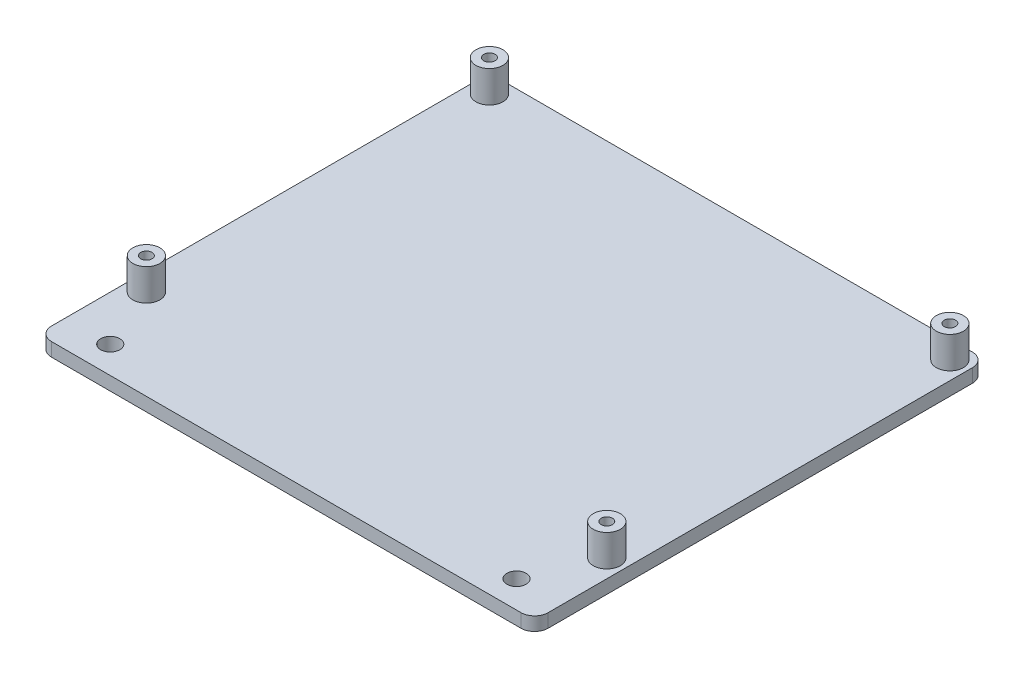
ISO-10303-21;
HEADER;
FILE_DESCRIPTION(('STEP AP214'),'2;1');
FILE_NAME('part.step','',(''),(''),'','','');
FILE_SCHEMA(('AUTOMOTIVE_DESIGN { 1 0 10303 214 1 1 1 1 }'));
ENDSEC;
DATA;
#1=APPLICATION_CONTEXT('core data for automotive mechanical design processes');
#2=APPLICATION_PROTOCOL_DEFINITION('international standard','automotive_design',2000,#1);
#3=PRODUCT_CONTEXT('',#1,'mechanical');
#4=PRODUCT('Part','Part','',(#3));
#5=PRODUCT_RELATED_PRODUCT_CATEGORY('part','',(#4));
#6=PRODUCT_DEFINITION_FORMATION('','',#4);
#7=PRODUCT_DEFINITION_CONTEXT('part definition',#1,'design');
#8=PRODUCT_DEFINITION('design','',#6,#7);
#9=PRODUCT_DEFINITION_SHAPE('','',#8);
#10=(LENGTH_UNIT() NAMED_UNIT(*) SI_UNIT(.MILLI.,.METRE.));
#11=(NAMED_UNIT(*) PLANE_ANGLE_UNIT() SI_UNIT($,.RADIAN.));
#12=(NAMED_UNIT(*) SI_UNIT($,.STERADIAN.) SOLID_ANGLE_UNIT());
#13=UNCERTAINTY_MEASURE_WITH_UNIT(LENGTH_MEASURE(1.E-05),#10,'distance_accuracy_value','');
#14=(GEOMETRIC_REPRESENTATION_CONTEXT(3) GLOBAL_UNCERTAINTY_ASSIGNED_CONTEXT((#13)) GLOBAL_UNIT_ASSIGNED_CONTEXT((#10,
#11,#12)) REPRESENTATION_CONTEXT('',''));
#15=CARTESIAN_POINT('',(0.,0.,0.));
#16=DIRECTION('',(0.,0.,1.));
#17=DIRECTION('',(1.,0.,0.));
#18=AXIS2_PLACEMENT_3D('',#15,#16,#17);
#19=CARTESIAN_POINT('',(0.,3.,0.));
#20=DIRECTION('',(0.,-1.,0.));
#21=DIRECTION('',(0.,0.,-1.));
#22=AXIS2_PLACEMENT_3D('',#19,#20,#21);
#23=PLANE('',#22);
#24=CARTESIAN_POINT('',(10.,3.,-6.));
#25=DIRECTION('',(0.,-1.,0.));
#26=DIRECTION('',(0.,0.,-1.));
#27=AXIS2_PLACEMENT_3D('',#24,#25,#26);
#28=CIRCLE('',#27,2.125);
#29=CARTESIAN_POINT('',(10.,3.,-8.125));
#30=VERTEX_POINT('',#29);
#31=EDGE_CURVE('E319',#30,#30,#28,.T.);
#32=ORIENTED_EDGE('',*,*,#31,.T.);
#33=EDGE_LOOP('',(#32));
#34=FACE_BOUND('',#33,.T.);
#35=CARTESIAN_POINT('',(100.,3.,-6.));
#36=DIRECTION('',(0.,-1.,0.));
#37=DIRECTION('',(0.,0.,-1.));
#38=AXIS2_PLACEMENT_3D('',#35,#36,#37);
#39=CIRCLE('',#38,2.125);
#40=CARTESIAN_POINT('',(100.,3.,-8.125));
#41=VERTEX_POINT('',#40);
#42=EDGE_CURVE('E322',#41,#41,#39,.T.);
#43=ORIENTED_EDGE('',*,*,#42,.T.);
#44=EDGE_LOOP('',(#43));
#45=FACE_BOUND('',#44,.T.);
#46=CARTESIAN_POINT('',(106.,3.,-20.));
#47=DIRECTION('',(0.,-1.,0.));
#48=DIRECTION('',(0.,0.,-1.));
#49=AXIS2_PLACEMENT_3D('',#46,#47,#48);
#50=CIRCLE('',#49,3.00000000000001);
#51=CARTESIAN_POINT('',(106.,3.,-23.));
#52=VERTEX_POINT('',#51);
#53=EDGE_CURVE('E42',#52,#52,#50,.F.);
#54=ORIENTED_EDGE('',*,*,#53,.F.);
#55=EDGE_LOOP('',(#54));
#56=FACE_BOUND('',#55,.T.);
#57=CARTESIAN_POINT('',(4.,3.,-96.));
#58=DIRECTION('',(0.,-1.,0.));
#59=DIRECTION('',(0.,0.,-1.));
#60=AXIS2_PLACEMENT_3D('',#57,#58,#59);
#61=CIRCLE('',#60,3.);
#62=CARTESIAN_POINT('',(4.,3.,-99.));
#63=VERTEX_POINT('',#62);
#64=EDGE_CURVE('E169',#63,#63,#61,.F.);
#65=ORIENTED_EDGE('',*,*,#64,.F.);
#66=EDGE_LOOP('',(#65));
#67=FACE_BOUND('',#66,.T.);
#68=DIRECTION('',(0.,0.,1.));
#69=VECTOR('',#68,1.);
#70=CARTESIAN_POINT('',(0.,3.,0.));
#71=LINE('',#70,#69);
#72=CARTESIAN_POINT('',(0.,3.,-97.));
#73=VERTEX_POINT('',#72);
#74=CARTESIAN_POINT('',(0.,3.,-3.));
#75=VERTEX_POINT('',#74);
#76=EDGE_CURVE('E144',#73,#75,#71,.T.);
#77=ORIENTED_EDGE('',*,*,#76,.T.);
#78=CARTESIAN_POINT('',(3.,3.,-3.));
#79=DIRECTION('',(0.,-1.,0.));
#80=DIRECTION('',(0.,0.,-1.));
#81=AXIS2_PLACEMENT_3D('',#78,#79,#80);
#82=CIRCLE('',#81,3.);
#83=CARTESIAN_POINT('',(3.,3.,0.));
#84=VERTEX_POINT('',#83);
#85=EDGE_CURVE('E158',#75,#84,#82,.F.);
#86=ORIENTED_EDGE('',*,*,#85,.T.);
#87=DIRECTION('',(1.,0.,0.));
#88=VECTOR('',#87,1.);
#89=CARTESIAN_POINT('',(0.,3.,0.));
#90=LINE('',#89,#88);
#91=CARTESIAN_POINT('',(107.,3.,0.));
#92=VERTEX_POINT('',#91);
#93=EDGE_CURVE('E121',#84,#92,#90,.T.);
#94=ORIENTED_EDGE('',*,*,#93,.T.);
#95=CARTESIAN_POINT('',(107.,3.,-3.));
#96=DIRECTION('',(0.,-1.,0.));
#97=DIRECTION('',(0.,0.,-1.));
#98=AXIS2_PLACEMENT_3D('',#95,#96,#97);
#99=CIRCLE('',#98,3.);
#100=CARTESIAN_POINT('',(110.,3.,-3.));
#101=VERTEX_POINT('',#100);
#102=EDGE_CURVE('E156',#92,#101,#99,.F.);
#103=ORIENTED_EDGE('',*,*,#102,.T.);
#104=DIRECTION('',(0.,0.,-1.));
#105=VECTOR('',#104,1.);
#106=CARTESIAN_POINT('',(110.,3.,0.));
#107=LINE('',#106,#105);
#108=CARTESIAN_POINT('',(110.,3.,-97.));
#109=VERTEX_POINT('',#108);
#110=EDGE_CURVE('E278',#101,#109,#107,.T.);
#111=ORIENTED_EDGE('',*,*,#110,.T.);
#112=CARTESIAN_POINT('',(107.,3.,-97.));
#113=DIRECTION('',(0.,-1.,0.));
#114=DIRECTION('',(0.,0.,-1.));
#115=AXIS2_PLACEMENT_3D('',#112,#113,#114);
#116=CIRCLE('',#115,3.);
#117=CARTESIAN_POINT('',(107.,3.,-100.));
#118=VERTEX_POINT('',#117);
#119=EDGE_CURVE('E56',#109,#118,#116,.F.);
#120=ORIENTED_EDGE('',*,*,#119,.T.);
#121=DIRECTION('',(-1.,0.,0.));
#122=VECTOR('',#121,1.);
#123=CARTESIAN_POINT('',(0.,3.,-100.));
#124=LINE('',#123,#122);
#125=CARTESIAN_POINT('',(3.,3.,-100.));
#126=VERTEX_POINT('',#125);
#127=EDGE_CURVE('E138',#118,#126,#124,.T.);
#128=ORIENTED_EDGE('',*,*,#127,.T.);
#129=CARTESIAN_POINT('',(3.,3.,-97.));
#130=DIRECTION('',(0.,-1.,0.));
#131=DIRECTION('',(0.,0.,-1.));
#132=AXIS2_PLACEMENT_3D('',#129,#130,#131);
#133=CIRCLE('',#132,3.);
#134=EDGE_CURVE('E154',#126,#73,#133,.F.);
#135=ORIENTED_EDGE('',*,*,#134,.T.);
#136=EDGE_LOOP('',(#77,#86,#94,#103,#111,#120,#128,#135));
#137=FACE_BOUND('',#136,.T.);
#138=CARTESIAN_POINT('',(106.,3.,-96.));
#139=DIRECTION('',(0.,-1.,0.));
#140=DIRECTION('',(0.,0.,-1.));
#141=AXIS2_PLACEMENT_3D('',#138,#139,#140);
#142=CIRCLE('',#141,3.00000000000001);
#143=CARTESIAN_POINT('',(106.,3.,-99.));
#144=VERTEX_POINT('',#143);
#145=EDGE_CURVE('E172',#144,#144,#142,.F.);
#146=ORIENTED_EDGE('',*,*,#145,.F.);
#147=EDGE_LOOP('',(#146));
#148=FACE_BOUND('',#147,.T.);
#149=CARTESIAN_POINT('',(4.,3.,-20.));
#150=DIRECTION('',(0.,-1.,0.));
#151=DIRECTION('',(0.,0.,-1.));
#152=AXIS2_PLACEMENT_3D('',#149,#150,#151);
#153=CIRCLE('',#152,3.);
#154=CARTESIAN_POINT('',(4.,3.,-23.));
#155=VERTEX_POINT('',#154);
#156=EDGE_CURVE('E11',#155,#155,#153,.F.);
#157=ORIENTED_EDGE('',*,*,#156,.F.);
#158=EDGE_LOOP('',(#157));
#159=FACE_BOUND('',#158,.T.);
#160=ADVANCED_FACE('F34',(#34,#45,#56,#67,#137,#148,#159),#23,.F.);
#161=CARTESIAN_POINT('',(0.,0.,0.));
#162=DIRECTION('',(0.,-1.,0.));
#163=DIRECTION('',(0.,0.,-1.));
#164=AXIS2_PLACEMENT_3D('',#161,#162,#163);
#165=PLANE('',#164);
#166=CARTESIAN_POINT('',(10.,0.,-6.));
#167=DIRECTION('',(0.,-1.,0.));
#168=DIRECTION('',(0.,0.,-1.));
#169=AXIS2_PLACEMENT_3D('',#166,#167,#168);
#170=CIRCLE('',#169,2.125);
#171=CARTESIAN_POINT('',(10.,0.,-8.125));
#172=VERTEX_POINT('',#171);
#173=EDGE_CURVE('E325',#172,#172,#170,.T.);
#174=ORIENTED_EDGE('',*,*,#173,.F.);
#175=EDGE_LOOP('',(#174));
#176=FACE_BOUND('',#175,.T.);
#177=CARTESIAN_POINT('',(100.,0.,-6.));
#178=DIRECTION('',(0.,-1.,0.));
#179=DIRECTION('',(0.,0.,-1.));
#180=AXIS2_PLACEMENT_3D('',#177,#178,#179);
#181=CIRCLE('',#180,2.125);
#182=CARTESIAN_POINT('',(100.,0.,-8.125));
#183=VERTEX_POINT('',#182);
#184=EDGE_CURVE('E326',#183,#183,#181,.T.);
#185=ORIENTED_EDGE('',*,*,#184,.F.);
#186=EDGE_LOOP('',(#185));
#187=FACE_BOUND('',#186,.T.);
#188=CARTESIAN_POINT('',(106.,0.,-20.));
#189=DIRECTION('',(0.,1.,0.));
#190=DIRECTION('',(0.,0.,1.));
#191=AXIS2_PLACEMENT_3D('',#188,#189,#190);
#192=CIRCLE('',#191,1.25);
#193=CARTESIAN_POINT('',(106.,0.,-18.75));
#194=VERTEX_POINT('',#193);
#195=EDGE_CURVE('E289',#194,#194,#192,.T.);
#196=ORIENTED_EDGE('',*,*,#195,.T.);
#197=EDGE_LOOP('',(#196));
#198=FACE_BOUND('',#197,.T.);
#199=CARTESIAN_POINT('',(4.,0.,-96.));
#200=DIRECTION('',(0.,1.,0.));
#201=DIRECTION('',(0.,0.,1.));
#202=AXIS2_PLACEMENT_3D('',#199,#200,#201);
#203=CIRCLE('',#202,1.25);
#204=CARTESIAN_POINT('',(4.,0.,-94.75));
#205=VERTEX_POINT('',#204);
#206=EDGE_CURVE('E129',#205,#205,#203,.T.);
#207=ORIENTED_EDGE('',*,*,#206,.T.);
#208=EDGE_LOOP('',(#207));
#209=FACE_BOUND('',#208,.T.);
#210=DIRECTION('',(1.,0.,0.));
#211=VECTOR('',#210,1.);
#212=CARTESIAN_POINT('',(0.,0.,0.));
#213=LINE('',#212,#211);
#214=CARTESIAN_POINT('',(3.,0.,0.));
#215=VERTEX_POINT('',#214);
#216=CARTESIAN_POINT('',(107.,0.,0.));
#217=VERTEX_POINT('',#216);
#218=EDGE_CURVE('E118',#215,#217,#213,.T.);
#219=ORIENTED_EDGE('',*,*,#218,.F.);
#220=CARTESIAN_POINT('',(3.,0.,-3.));
#221=DIRECTION('',(0.,-1.,0.));
#222=DIRECTION('',(0.,0.,-1.));
#223=AXIS2_PLACEMENT_3D('',#220,#221,#222);
#224=CIRCLE('',#223,3.);
#225=CARTESIAN_POINT('',(0.,0.,-3.00000000000003));
#226=VERTEX_POINT('',#225);
#227=EDGE_CURVE('E101',#215,#226,#224,.T.);
#228=ORIENTED_EDGE('',*,*,#227,.T.);
#229=DIRECTION('',(0.,0.,1.));
#230=VECTOR('',#229,1.);
#231=CARTESIAN_POINT('',(0.,0.,-100.));
#232=LINE('',#231,#230);
#233=CARTESIAN_POINT('',(0.,0.,-97.));
#234=VERTEX_POINT('',#233);
#235=EDGE_CURVE('E142',#234,#226,#232,.T.);
#236=ORIENTED_EDGE('',*,*,#235,.F.);
#237=CARTESIAN_POINT('',(3.,0.,-97.));
#238=DIRECTION('',(0.,-1.,0.));
#239=DIRECTION('',(0.,0.,-1.));
#240=AXIS2_PLACEMENT_3D('',#237,#238,#239);
#241=CIRCLE('',#240,3.);
#242=CARTESIAN_POINT('',(3.,0.,-100.));
#243=VERTEX_POINT('',#242);
#244=EDGE_CURVE('E147',#234,#243,#241,.T.);
#245=ORIENTED_EDGE('',*,*,#244,.T.);
#246=DIRECTION('',(-1.,0.,0.));
#247=VECTOR('',#246,1.);
#248=CARTESIAN_POINT('',(0.,0.,-100.));
#249=LINE('',#248,#247);
#250=CARTESIAN_POINT('',(107.,0.,-100.));
#251=VERTEX_POINT('',#250);
#252=EDGE_CURVE('E132',#251,#243,#249,.T.);
#253=ORIENTED_EDGE('',*,*,#252,.F.);
#254=CARTESIAN_POINT('',(107.,0.,-97.));
#255=DIRECTION('',(0.,-1.,0.));
#256=DIRECTION('',(0.,0.,-1.));
#257=AXIS2_PLACEMENT_3D('',#254,#255,#256);
#258=CIRCLE('',#257,3.);
#259=CARTESIAN_POINT('',(110.,0.,-97.));
#260=VERTEX_POINT('',#259);
#261=EDGE_CURVE('E122',#251,#260,#258,.T.);
#262=ORIENTED_EDGE('',*,*,#261,.T.);
#263=DIRECTION('',(0.,0.,-1.));
#264=VECTOR('',#263,1.);
#265=CARTESIAN_POINT('',(110.,0.,-100.));
#266=LINE('',#265,#264);
#267=CARTESIAN_POINT('',(110.,0.,-3.00000000000003));
#268=VERTEX_POINT('',#267);
#269=EDGE_CURVE('E128',#268,#260,#266,.T.);
#270=ORIENTED_EDGE('',*,*,#269,.F.);
#271=CARTESIAN_POINT('',(107.,0.,-3.));
#272=DIRECTION('',(0.,-1.,0.));
#273=DIRECTION('',(0.,0.,-1.));
#274=AXIS2_PLACEMENT_3D('',#271,#272,#273);
#275=CIRCLE('',#274,3.);
#276=EDGE_CURVE('E112',#268,#217,#275,.T.);
#277=ORIENTED_EDGE('',*,*,#276,.T.);
#278=EDGE_LOOP('',(#219,#228,#236,#245,#253,#262,#270,#277));
#279=FACE_BOUND('',#278,.T.);
#280=CARTESIAN_POINT('',(106.,0.,-96.));
#281=DIRECTION('',(0.,1.,0.));
#282=DIRECTION('',(0.,0.,1.));
#283=AXIS2_PLACEMENT_3D('',#280,#281,#282);
#284=CIRCLE('',#283,1.25);
#285=CARTESIAN_POINT('',(106.,0.,-94.75));
#286=VERTEX_POINT('',#285);
#287=EDGE_CURVE('E135',#286,#286,#284,.T.);
#288=ORIENTED_EDGE('',*,*,#287,.T.);
#289=EDGE_LOOP('',(#288));
#290=FACE_BOUND('',#289,.T.);
#291=CARTESIAN_POINT('',(4.,0.,-20.));
#292=DIRECTION('',(0.,1.,0.));
#293=DIRECTION('',(0.,0.,1.));
#294=AXIS2_PLACEMENT_3D('',#291,#292,#293);
#295=CIRCLE('',#294,1.25);
#296=CARTESIAN_POINT('',(4.,0.,-18.75));
#297=VERTEX_POINT('',#296);
#298=EDGE_CURVE('E292',#297,#297,#295,.T.);
#299=ORIENTED_EDGE('',*,*,#298,.T.);
#300=EDGE_LOOP('',(#299));
#301=FACE_BOUND('',#300,.T.);
#302=ADVANCED_FACE('F125',(#176,#187,#198,#209,#279,#290,#301),#165,.T.);
#303=CARTESIAN_POINT('',(0.,3.,0.));
#304=DIRECTION('',(0.,0.,-1.));
#305=DIRECTION('',(-1.,0.,0.));
#306=AXIS2_PLACEMENT_3D('',#303,#304,#305);
#307=PLANE('',#306);
#308=ORIENTED_EDGE('',*,*,#93,.F.);
#309=DIRECTION('',(0.,-1.,0.));
#310=VECTOR('',#309,1.);
#311=CARTESIAN_POINT('',(3.,3.,0.));
#312=LINE('',#311,#310);
#313=EDGE_CURVE('E105',#84,#215,#312,.T.);
#314=ORIENTED_EDGE('',*,*,#313,.T.);
#315=ORIENTED_EDGE('',*,*,#218,.T.);
#316=DIRECTION('',(0.,-1.,0.));
#317=VECTOR('',#316,1.);
#318=CARTESIAN_POINT('',(107.,3.,0.));
#319=LINE('',#318,#317);
#320=EDGE_CURVE('E123',#217,#92,#319,.F.);
#321=ORIENTED_EDGE('',*,*,#320,.T.);
#322=EDGE_LOOP('',(#308,#314,#315,#321));
#323=FACE_BOUND('',#322,.T.);
#324=ADVANCED_FACE('F117',(#323),#307,.F.);
#325=CARTESIAN_POINT('',(110.,3.,-100.));
#326=DIRECTION('',(-1.,0.,0.));
#327=DIRECTION('',(0.,0.,1.));
#328=AXIS2_PLACEMENT_3D('',#325,#326,#327);
#329=PLANE('',#328);
#330=ORIENTED_EDGE('',*,*,#110,.F.);
#331=DIRECTION('',(0.,-1.,0.));
#332=VECTOR('',#331,1.);
#333=CARTESIAN_POINT('',(110.,3.,-3.));
#334=LINE('',#333,#332);
#335=EDGE_CURVE('E162',#101,#268,#334,.T.);
#336=ORIENTED_EDGE('',*,*,#335,.T.);
#337=ORIENTED_EDGE('',*,*,#269,.T.);
#338=DIRECTION('',(0.,-1.,0.));
#339=VECTOR('',#338,1.);
#340=CARTESIAN_POINT('',(110.,3.,-97.));
#341=LINE('',#340,#339);
#342=EDGE_CURVE('E160',#260,#109,#341,.F.);
#343=ORIENTED_EDGE('',*,*,#342,.T.);
#344=EDGE_LOOP('',(#330,#336,#337,#343));
#345=FACE_BOUND('',#344,.T.);
#346=ADVANCED_FACE('F257',(#345),#329,.F.);
#347=CARTESIAN_POINT('',(0.,3.,-100.));
#348=DIRECTION('',(0.,0.,1.));
#349=DIRECTION('',(1.,0.,0.));
#350=AXIS2_PLACEMENT_3D('',#347,#348,#349);
#351=PLANE('',#350);
#352=ORIENTED_EDGE('',*,*,#252,.T.);
#353=DIRECTION('',(0.,-1.,0.));
#354=VECTOR('',#353,1.);
#355=CARTESIAN_POINT('',(3.,3.,-100.));
#356=LINE('',#355,#354);
#357=EDGE_CURVE('E49',#243,#126,#356,.F.);
#358=ORIENTED_EDGE('',*,*,#357,.T.);
#359=ORIENTED_EDGE('',*,*,#127,.F.);
#360=DIRECTION('',(0.,-1.,0.));
#361=VECTOR('',#360,1.);
#362=CARTESIAN_POINT('',(107.,3.,-100.));
#363=LINE('',#362,#361);
#364=EDGE_CURVE('E165',#118,#251,#363,.T.);
#365=ORIENTED_EDGE('',*,*,#364,.T.);
#366=EDGE_LOOP('',(#352,#358,#359,#365));
#367=FACE_BOUND('',#366,.T.);
#368=ADVANCED_FACE('F253',(#367),#351,.F.);
#369=CARTESIAN_POINT('',(0.,3.,-100.));
#370=DIRECTION('',(1.,0.,0.));
#371=DIRECTION('',(0.,0.,-1.));
#372=AXIS2_PLACEMENT_3D('',#369,#370,#371);
#373=PLANE('',#372);
#374=ORIENTED_EDGE('',*,*,#235,.T.);
#375=DIRECTION('',(0.,-1.,0.));
#376=VECTOR('',#375,1.);
#377=CARTESIAN_POINT('',(0.,3.,-3.));
#378=LINE('',#377,#376);
#379=EDGE_CURVE('E106',#226,#75,#378,.F.);
#380=ORIENTED_EDGE('',*,*,#379,.T.);
#381=ORIENTED_EDGE('',*,*,#76,.F.);
#382=DIRECTION('',(0.,-1.,0.));
#383=VECTOR('',#382,1.);
#384=CARTESIAN_POINT('',(0.,3.,-97.));
#385=LINE('',#384,#383);
#386=EDGE_CURVE('E111',#73,#234,#385,.T.);
#387=ORIENTED_EDGE('',*,*,#386,.T.);
#388=EDGE_LOOP('',(#374,#380,#381,#387));
#389=FACE_BOUND('',#388,.T.);
#390=ADVANCED_FACE('F245',(#389),#373,.F.);
#391=CARTESIAN_POINT('',(4.,3.,-96.));
#392=DIRECTION('',(0.,-1.,0.));
#393=DIRECTION('',(0.,0.,-1.));
#394=AXIS2_PLACEMENT_3D('',#391,#392,#393);
#395=CYLINDRICAL_SURFACE('',#394,1.25);
#396=ORIENTED_EDGE('',*,*,#206,.F.);
#397=EDGE_LOOP('',(#396));
#398=FACE_BOUND('',#397,.T.);
#399=CARTESIAN_POINT('',(4.,10.,-96.));
#400=DIRECTION('',(0.,1.,0.));
#401=DIRECTION('',(0.,0.,1.));
#402=AXIS2_PLACEMENT_3D('',#399,#400,#401);
#403=CIRCLE('',#402,1.25);
#404=CARTESIAN_POINT('',(4.,10.,-94.75));
#405=VERTEX_POINT('',#404);
#406=EDGE_CURVE('E298',#405,#405,#403,.T.);
#407=ORIENTED_EDGE('',*,*,#406,.T.);
#408=EDGE_LOOP('',(#407));
#409=FACE_BOUND('',#408,.T.);
#410=ADVANCED_FACE('F242',(#398,#409),#395,.F.);
#411=CARTESIAN_POINT('',(106.,3.,-96.));
#412=DIRECTION('',(0.,-1.,0.));
#413=DIRECTION('',(0.,0.,-1.));
#414=AXIS2_PLACEMENT_3D('',#411,#412,#413);
#415=CYLINDRICAL_SURFACE('',#414,1.25);
#416=ORIENTED_EDGE('',*,*,#287,.F.);
#417=EDGE_LOOP('',(#416));
#418=FACE_BOUND('',#417,.T.);
#419=CARTESIAN_POINT('',(106.,10.,-96.));
#420=DIRECTION('',(0.,1.,0.));
#421=DIRECTION('',(0.,0.,1.));
#422=AXIS2_PLACEMENT_3D('',#419,#420,#421);
#423=CIRCLE('',#422,1.25);
#424=CARTESIAN_POINT('',(106.,10.,-94.75));
#425=VERTEX_POINT('',#424);
#426=EDGE_CURVE('E304',#425,#425,#423,.T.);
#427=ORIENTED_EDGE('',*,*,#426,.T.);
#428=EDGE_LOOP('',(#427));
#429=FACE_BOUND('',#428,.T.);
#430=ADVANCED_FACE('F238',(#418,#429),#415,.F.);
#431=CARTESIAN_POINT('',(106.,3.,-20.));
#432=DIRECTION('',(0.,-1.,0.));
#433=DIRECTION('',(0.,0.,-1.));
#434=AXIS2_PLACEMENT_3D('',#431,#432,#433);
#435=CYLINDRICAL_SURFACE('',#434,1.25);
#436=ORIENTED_EDGE('',*,*,#195,.F.);
#437=EDGE_LOOP('',(#436));
#438=FACE_BOUND('',#437,.T.);
#439=CARTESIAN_POINT('',(106.,10.,-20.));
#440=DIRECTION('',(0.,1.,0.));
#441=DIRECTION('',(0.,0.,1.));
#442=AXIS2_PLACEMENT_3D('',#439,#440,#441);
#443=CIRCLE('',#442,1.25);
#444=CARTESIAN_POINT('',(106.,10.,-18.75));
#445=VERTEX_POINT('',#444);
#446=EDGE_CURVE('E310',#445,#445,#443,.T.);
#447=ORIENTED_EDGE('',*,*,#446,.T.);
#448=EDGE_LOOP('',(#447));
#449=FACE_BOUND('',#448,.T.);
#450=ADVANCED_FACE('F234',(#438,#449),#435,.F.);
#451=CARTESIAN_POINT('',(4.,3.,-20.));
#452=DIRECTION('',(0.,-1.,0.));
#453=DIRECTION('',(0.,0.,-1.));
#454=AXIS2_PLACEMENT_3D('',#451,#452,#453);
#455=CYLINDRICAL_SURFACE('',#454,1.25);
#456=ORIENTED_EDGE('',*,*,#298,.F.);
#457=EDGE_LOOP('',(#456));
#458=FACE_BOUND('',#457,.T.);
#459=CARTESIAN_POINT('',(4.,10.,-20.));
#460=DIRECTION('',(0.,1.,0.));
#461=DIRECTION('',(0.,0.,1.));
#462=AXIS2_PLACEMENT_3D('',#459,#460,#461);
#463=CIRCLE('',#462,1.25);
#464=CARTESIAN_POINT('',(4.,10.,-18.75));
#465=VERTEX_POINT('',#464);
#466=EDGE_CURVE('E316',#465,#465,#463,.T.);
#467=ORIENTED_EDGE('',*,*,#466,.T.);
#468=EDGE_LOOP('',(#467));
#469=FACE_BOUND('',#468,.T.);
#470=ADVANCED_FACE('F231',(#458,#469),#455,.F.);
#471=CARTESIAN_POINT('',(3.,3.,-3.));
#472=DIRECTION('',(0.,-1.,0.));
#473=DIRECTION('',(0.,0.,-1.));
#474=AXIS2_PLACEMENT_3D('',#471,#472,#473);
#475=CYLINDRICAL_SURFACE('',#474,3.);
#476=ORIENTED_EDGE('',*,*,#85,.F.);
#477=ORIENTED_EDGE('',*,*,#379,.F.);
#478=ORIENTED_EDGE('',*,*,#227,.F.);
#479=ORIENTED_EDGE('',*,*,#313,.F.);
#480=EDGE_LOOP('',(#476,#477,#478,#479));
#481=FACE_BOUND('',#480,.T.);
#482=ADVANCED_FACE('F104',(#481),#475,.T.);
#483=CARTESIAN_POINT('',(107.,3.,-3.));
#484=DIRECTION('',(0.,-1.,0.));
#485=DIRECTION('',(0.,0.,-1.));
#486=AXIS2_PLACEMENT_3D('',#483,#484,#485);
#487=CYLINDRICAL_SURFACE('',#486,3.);
#488=ORIENTED_EDGE('',*,*,#102,.F.);
#489=ORIENTED_EDGE('',*,*,#320,.F.);
#490=ORIENTED_EDGE('',*,*,#276,.F.);
#491=ORIENTED_EDGE('',*,*,#335,.F.);
#492=EDGE_LOOP('',(#488,#489,#490,#491));
#493=FACE_BOUND('',#492,.T.);
#494=ADVANCED_FACE('F265',(#493),#487,.T.);
#495=CARTESIAN_POINT('',(3.,3.,-97.));
#496=DIRECTION('',(0.,-1.,0.));
#497=DIRECTION('',(0.,0.,-1.));
#498=AXIS2_PLACEMENT_3D('',#495,#496,#497);
#499=CYLINDRICAL_SURFACE('',#498,3.);
#500=ORIENTED_EDGE('',*,*,#134,.F.);
#501=ORIENTED_EDGE('',*,*,#357,.F.);
#502=ORIENTED_EDGE('',*,*,#244,.F.);
#503=ORIENTED_EDGE('',*,*,#386,.F.);
#504=EDGE_LOOP('',(#500,#501,#502,#503));
#505=FACE_BOUND('',#504,.T.);
#506=ADVANCED_FACE('F267',(#505),#499,.T.);
#507=CARTESIAN_POINT('',(107.,3.,-97.));
#508=DIRECTION('',(0.,-1.,0.));
#509=DIRECTION('',(0.,0.,-1.));
#510=AXIS2_PLACEMENT_3D('',#507,#508,#509);
#511=CYLINDRICAL_SURFACE('',#510,3.);
#512=ORIENTED_EDGE('',*,*,#119,.F.);
#513=ORIENTED_EDGE('',*,*,#342,.F.);
#514=ORIENTED_EDGE('',*,*,#261,.F.);
#515=ORIENTED_EDGE('',*,*,#364,.F.);
#516=EDGE_LOOP('',(#512,#513,#514,#515));
#517=FACE_BOUND('',#516,.T.);
#518=ADVANCED_FACE('F36',(#517),#511,.T.);
#519=CARTESIAN_POINT('',(4.,10.,-96.));
#520=DIRECTION('',(0.,1.,0.));
#521=DIRECTION('',(0.,0.,1.));
#522=AXIS2_PLACEMENT_3D('',#519,#520,#521);
#523=PLANE('',#522);
#524=CARTESIAN_POINT('',(4.,10.,-96.));
#525=DIRECTION('',(0.,1.,0.));
#526=DIRECTION('',(0.,0.,1.));
#527=AXIS2_PLACEMENT_3D('',#524,#525,#526);
#528=CIRCLE('',#527,3.);
#529=CARTESIAN_POINT('',(4.,10.,-93.));
#530=VERTEX_POINT('',#529);
#531=EDGE_CURVE('E295',#530,#530,#528,.T.);
#532=ORIENTED_EDGE('',*,*,#531,.T.);
#533=EDGE_LOOP('',(#532));
#534=FACE_BOUND('',#533,.T.);
#535=ORIENTED_EDGE('',*,*,#406,.F.);
#536=EDGE_LOOP('',(#535));
#537=FACE_BOUND('',#536,.T.);
#538=ADVANCED_FACE('F224',(#534,#537),#523,.T.);
#539=CARTESIAN_POINT('',(4.,10.,-96.));
#540=DIRECTION('',(0.,-1.,0.));
#541=DIRECTION('',(0.,0.,-1.));
#542=AXIS2_PLACEMENT_3D('',#539,#540,#541);
#543=CYLINDRICAL_SURFACE('',#542,3.);
#544=ORIENTED_EDGE('',*,*,#531,.F.);
#545=EDGE_LOOP('',(#544));
#546=FACE_BOUND('',#545,.T.);
#547=ORIENTED_EDGE('',*,*,#64,.T.);
#548=EDGE_LOOP('',(#547));
#549=FACE_BOUND('',#548,.T.);
#550=ADVANCED_FACE('F219',(#546,#549),#543,.T.);
#551=CARTESIAN_POINT('',(106.,10.,-96.));
#552=DIRECTION('',(0.,1.,0.));
#553=DIRECTION('',(0.,0.,1.));
#554=AXIS2_PLACEMENT_3D('',#551,#552,#553);
#555=PLANE('',#554);
#556=CARTESIAN_POINT('',(106.,10.,-96.));
#557=DIRECTION('',(0.,1.,0.));
#558=DIRECTION('',(0.,0.,1.));
#559=AXIS2_PLACEMENT_3D('',#556,#557,#558);
#560=CIRCLE('',#559,3.00000000000001);
#561=CARTESIAN_POINT('',(106.,10.,-93.));
#562=VERTEX_POINT('',#561);
#563=EDGE_CURVE('E301',#562,#562,#560,.T.);
#564=ORIENTED_EDGE('',*,*,#563,.T.);
#565=EDGE_LOOP('',(#564));
#566=FACE_BOUND('',#565,.T.);
#567=ORIENTED_EDGE('',*,*,#426,.F.);
#568=EDGE_LOOP('',(#567));
#569=FACE_BOUND('',#568,.T.);
#570=ADVANCED_FACE('F216',(#566,#569),#555,.T.);
#571=CARTESIAN_POINT('',(106.,10.,-96.));
#572=DIRECTION('',(0.,-1.,0.));
#573=DIRECTION('',(0.,0.,-1.));
#574=AXIS2_PLACEMENT_3D('',#571,#572,#573);
#575=CYLINDRICAL_SURFACE('',#574,3.00000000000001);
#576=ORIENTED_EDGE('',*,*,#563,.F.);
#577=EDGE_LOOP('',(#576));
#578=FACE_BOUND('',#577,.T.);
#579=ORIENTED_EDGE('',*,*,#145,.T.);
#580=EDGE_LOOP('',(#579));
#581=FACE_BOUND('',#580,.T.);
#582=ADVANCED_FACE('F211',(#578,#581),#575,.T.);
#583=CARTESIAN_POINT('',(106.,10.,-20.));
#584=DIRECTION('',(0.,1.,0.));
#585=DIRECTION('',(0.,0.,1.));
#586=AXIS2_PLACEMENT_3D('',#583,#584,#585);
#587=PLANE('',#586);
#588=CARTESIAN_POINT('',(106.,10.,-20.));
#589=DIRECTION('',(0.,1.,0.));
#590=DIRECTION('',(0.,0.,1.));
#591=AXIS2_PLACEMENT_3D('',#588,#589,#590);
#592=CIRCLE('',#591,3.00000000000001);
#593=CARTESIAN_POINT('',(106.,10.,-17.));
#594=VERTEX_POINT('',#593);
#595=EDGE_CURVE('E307',#594,#594,#592,.T.);
#596=ORIENTED_EDGE('',*,*,#595,.T.);
#597=EDGE_LOOP('',(#596));
#598=FACE_BOUND('',#597,.T.);
#599=ORIENTED_EDGE('',*,*,#446,.F.);
#600=EDGE_LOOP('',(#599));
#601=FACE_BOUND('',#600,.T.);
#602=ADVANCED_FACE('F208',(#598,#601),#587,.T.);
#603=CARTESIAN_POINT('',(106.,10.,-20.));
#604=DIRECTION('',(0.,-1.,0.));
#605=DIRECTION('',(0.,0.,-1.));
#606=AXIS2_PLACEMENT_3D('',#603,#604,#605);
#607=CYLINDRICAL_SURFACE('',#606,3.00000000000001);
#608=ORIENTED_EDGE('',*,*,#595,.F.);
#609=EDGE_LOOP('',(#608));
#610=FACE_BOUND('',#609,.T.);
#611=ORIENTED_EDGE('',*,*,#53,.T.);
#612=EDGE_LOOP('',(#611));
#613=FACE_BOUND('',#612,.T.);
#614=ADVANCED_FACE('F177',(#610,#613),#607,.T.);
#615=CARTESIAN_POINT('',(4.,10.,-20.));
#616=DIRECTION('',(0.,1.,0.));
#617=DIRECTION('',(0.,0.,1.));
#618=AXIS2_PLACEMENT_3D('',#615,#616,#617);
#619=PLANE('',#618);
#620=CARTESIAN_POINT('',(4.,10.,-20.));
#621=DIRECTION('',(0.,1.,0.));
#622=DIRECTION('',(0.,0.,1.));
#623=AXIS2_PLACEMENT_3D('',#620,#621,#622);
#624=CIRCLE('',#623,3.);
#625=CARTESIAN_POINT('',(4.,10.,-17.));
#626=VERTEX_POINT('',#625);
#627=EDGE_CURVE('E313',#626,#626,#624,.T.);
#628=ORIENTED_EDGE('',*,*,#627,.T.);
#629=EDGE_LOOP('',(#628));
#630=FACE_BOUND('',#629,.T.);
#631=ORIENTED_EDGE('',*,*,#466,.F.);
#632=EDGE_LOOP('',(#631));
#633=FACE_BOUND('',#632,.T.);
#634=ADVANCED_FACE('F194',(#630,#633),#619,.T.);
#635=CARTESIAN_POINT('',(4.,10.,-20.));
#636=DIRECTION('',(0.,-1.,0.));
#637=DIRECTION('',(0.,0.,-1.));
#638=AXIS2_PLACEMENT_3D('',#635,#636,#637);
#639=CYLINDRICAL_SURFACE('',#638,3.);
#640=ORIENTED_EDGE('',*,*,#627,.F.);
#641=EDGE_LOOP('',(#640));
#642=FACE_BOUND('',#641,.T.);
#643=ORIENTED_EDGE('',*,*,#156,.T.);
#644=EDGE_LOOP('',(#643));
#645=FACE_BOUND('',#644,.T.);
#646=ADVANCED_FACE('F191',(#642,#645),#639,.T.);
#647=CARTESIAN_POINT('',(100.,10.,-6.));
#648=DIRECTION('',(0.,-1.,0.));
#649=DIRECTION('',(0.,0.,-1.));
#650=AXIS2_PLACEMENT_3D('',#647,#648,#649);
#651=CYLINDRICAL_SURFACE('',#650,2.125);
#652=ORIENTED_EDGE('',*,*,#184,.T.);
#653=EDGE_LOOP('',(#652));
#654=FACE_BOUND('',#653,.T.);
#655=ORIENTED_EDGE('',*,*,#42,.F.);
#656=EDGE_LOOP('',(#655));
#657=FACE_BOUND('',#656,.T.);
#658=ADVANCED_FACE('F193',(#654,#657),#651,.F.);
#659=CARTESIAN_POINT('',(10.,10.,-6.));
#660=DIRECTION('',(0.,-1.,0.));
#661=DIRECTION('',(0.,0.,-1.));
#662=AXIS2_PLACEMENT_3D('',#659,#660,#661);
#663=CYLINDRICAL_SURFACE('',#662,2.125);
#664=ORIENTED_EDGE('',*,*,#173,.T.);
#665=EDGE_LOOP('',(#664));
#666=FACE_BOUND('',#665,.T.);
#667=ORIENTED_EDGE('',*,*,#31,.F.);
#668=EDGE_LOOP('',(#667));
#669=FACE_BOUND('',#668,.T.);
#670=ADVANCED_FACE('F201',(#666,#669),#663,.F.);
#671=CLOSED_SHELL('',(#160,#302,#324,#346,#368,#390,#410,#430,#450,#470,#482,#494,#506,#518,
#538,#550,#570,#582,#602,#614,#634,#646,#658,#670));
#672=MANIFOLD_SOLID_BREP('B2',#671);
#673=ADVANCED_BREP_SHAPE_REPRESENTATION('',(#18,#672),#14);
#674=SHAPE_DEFINITION_REPRESENTATION(#9,#673);
ENDSEC;
END-ISO-10303-21;
